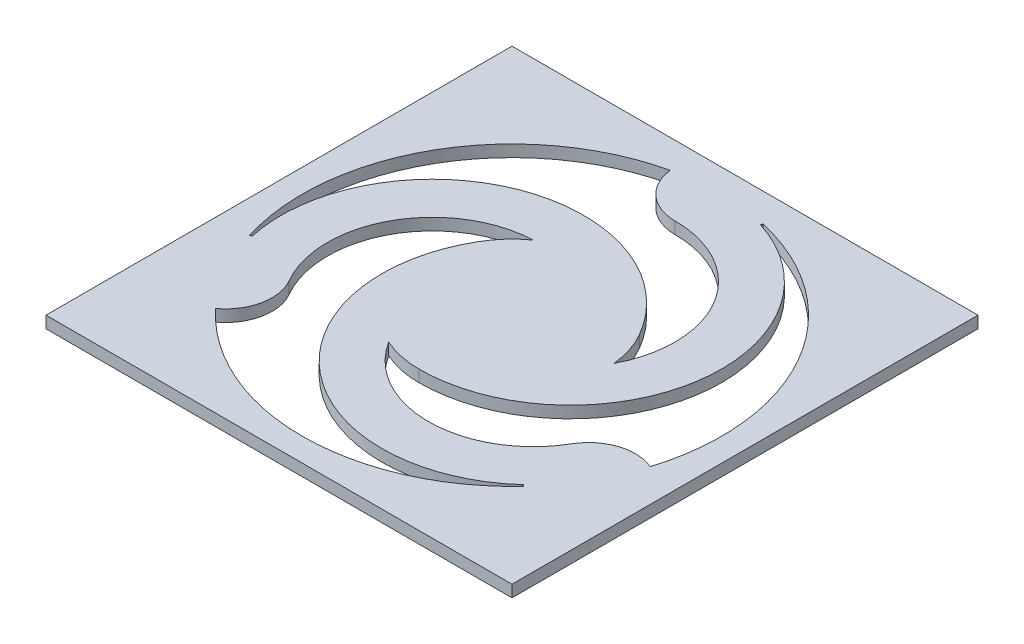
ISO-10303-21;
HEADER;
FILE_DESCRIPTION(('STEP AP214'),'2;1');
FILE_NAME('part.step','',(''),(''),'','','');
FILE_SCHEMA(('AUTOMOTIVE_DESIGN { 1 0 10303 214 1 1 1 1 }'));
ENDSEC;
DATA;
#1=APPLICATION_CONTEXT('core data for automotive mechanical design processes');
#2=APPLICATION_PROTOCOL_DEFINITION('international standard','automotive_design',2000,#1);
#3=PRODUCT_CONTEXT('',#1,'mechanical');
#4=PRODUCT('Part','Part','',(#3));
#5=PRODUCT_RELATED_PRODUCT_CATEGORY('part','',(#4));
#6=PRODUCT_DEFINITION_FORMATION('','',#4);
#7=PRODUCT_DEFINITION_CONTEXT('part definition',#1,'design');
#8=PRODUCT_DEFINITION('design','',#6,#7);
#9=PRODUCT_DEFINITION_SHAPE('','',#8);
#10=(LENGTH_UNIT() NAMED_UNIT(*) SI_UNIT(.MILLI.,.METRE.));
#11=(NAMED_UNIT(*) PLANE_ANGLE_UNIT() SI_UNIT($,.RADIAN.));
#12=(NAMED_UNIT(*) SI_UNIT($,.STERADIAN.) SOLID_ANGLE_UNIT());
#13=UNCERTAINTY_MEASURE_WITH_UNIT(LENGTH_MEASURE(1.E-05),#10,'distance_accuracy_value','');
#14=(GEOMETRIC_REPRESENTATION_CONTEXT(3) GLOBAL_UNCERTAINTY_ASSIGNED_CONTEXT((#13)) GLOBAL_UNIT_ASSIGNED_CONTEXT((#10,
#11,#12)) REPRESENTATION_CONTEXT('',''));
#15=CARTESIAN_POINT('',(0.,0.,0.));
#16=DIRECTION('',(0.,0.,1.));
#17=DIRECTION('',(1.,0.,0.));
#18=AXIS2_PLACEMENT_3D('',#15,#16,#17);
#19=CARTESIAN_POINT('',(0.,0.127,0.));
#20=DIRECTION('',(0.,0.,-1.));
#21=DIRECTION('',(-1.,0.,0.));
#22=AXIS2_PLACEMENT_3D('',#19,#20,#21);
#23=PLANE('',#22);
#24=DIRECTION('',(1.,0.,0.));
#25=VECTOR('',#24,1.);
#26=CARTESIAN_POINT('',(0.,0.,0.));
#27=LINE('',#26,#25);
#28=CARTESIAN_POINT('',(0.,0.,0.));
#29=VERTEX_POINT('',#28);
#30=CARTESIAN_POINT('',(5.,0.,0.));
#31=VERTEX_POINT('',#30);
#32=EDGE_CURVE('E291',#29,#31,#27,.T.);
#33=ORIENTED_EDGE('',*,*,#32,.T.);
#34=DIRECTION('',(0.,-1.,0.));
#35=VECTOR('',#34,1.);
#36=CARTESIAN_POINT('',(5.,0.127,0.));
#37=LINE('',#36,#35);
#38=CARTESIAN_POINT('',(5.,0.127,0.));
#39=VERTEX_POINT('',#38);
#40=EDGE_CURVE('E11',#39,#31,#37,.T.);
#41=ORIENTED_EDGE('',*,*,#40,.F.);
#42=DIRECTION('',(1.,0.,0.));
#43=VECTOR('',#42,1.);
#44=CARTESIAN_POINT('',(0.,0.127,0.));
#45=LINE('',#44,#43);
#46=CARTESIAN_POINT('',(0.,0.127,0.));
#47=VERTEX_POINT('',#46);
#48=EDGE_CURVE('E209',#47,#39,#45,.T.);
#49=ORIENTED_EDGE('',*,*,#48,.F.);
#50=DIRECTION('',(0.,-1.,0.));
#51=VECTOR('',#50,1.);
#52=CARTESIAN_POINT('',(0.,0.127,0.));
#53=LINE('',#52,#51);
#54=EDGE_CURVE('E63',#47,#29,#53,.T.);
#55=ORIENTED_EDGE('',*,*,#54,.T.);
#56=EDGE_LOOP('',(#33,#41,#49,#55));
#57=FACE_BOUND('',#56,.T.);
#58=ADVANCED_FACE('F43',(#57),#23,.F.);
#59=CARTESIAN_POINT('',(5.,0.127,0.));
#60=DIRECTION('',(-1.,0.,0.));
#61=DIRECTION('',(0.,0.,1.));
#62=AXIS2_PLACEMENT_3D('',#59,#60,#61);
#63=PLANE('',#62);
#64=DIRECTION('',(0.,0.,-1.));
#65=VECTOR('',#64,1.);
#66=CARTESIAN_POINT('',(5.,0.,0.));
#67=LINE('',#66,#65);
#68=CARTESIAN_POINT('',(5.,0.,-5.));
#69=VERTEX_POINT('',#68);
#70=EDGE_CURVE('E216',#31,#69,#67,.T.);
#71=ORIENTED_EDGE('',*,*,#70,.T.);
#72=DIRECTION('',(0.,-1.,0.));
#73=VECTOR('',#72,1.);
#74=CARTESIAN_POINT('',(5.,0.127,-5.));
#75=LINE('',#74,#73);
#76=CARTESIAN_POINT('',(5.,0.127,-5.));
#77=VERTEX_POINT('',#76);
#78=EDGE_CURVE('E54',#77,#69,#75,.T.);
#79=ORIENTED_EDGE('',*,*,#78,.F.);
#80=DIRECTION('',(0.,0.,-1.));
#81=VECTOR('',#80,1.);
#82=CARTESIAN_POINT('',(5.,0.127,0.));
#83=LINE('',#82,#81);
#84=EDGE_CURVE('E203',#39,#77,#83,.T.);
#85=ORIENTED_EDGE('',*,*,#84,.F.);
#86=ORIENTED_EDGE('',*,*,#40,.T.);
#87=EDGE_LOOP('',(#71,#79,#85,#86));
#88=FACE_BOUND('',#87,.T.);
#89=ADVANCED_FACE('F215',(#88),#63,.F.);
#90=CARTESIAN_POINT('',(0.,0.127,-5.));
#91=DIRECTION('',(0.,0.,-1.));
#92=DIRECTION('',(-1.,0.,0.));
#93=AXIS2_PLACEMENT_3D('',#90,#91,#92);
#94=PLANE('',#93);
#95=DIRECTION('',(1.,0.,0.));
#96=VECTOR('',#95,1.);
#97=CARTESIAN_POINT('',(0.,0.,-5.));
#98=LINE('',#97,#96);
#99=CARTESIAN_POINT('',(0.,0.,-5.));
#100=VERTEX_POINT('',#99);
#101=EDGE_CURVE('E296',#100,#69,#98,.T.);
#102=ORIENTED_EDGE('',*,*,#101,.F.);
#103=DIRECTION('',(0.,-1.,0.));
#104=VECTOR('',#103,1.);
#105=CARTESIAN_POINT('',(0.,0.127,-5.));
#106=LINE('',#105,#104);
#107=CARTESIAN_POINT('',(0.,0.127,-5.));
#108=VERTEX_POINT('',#107);
#109=EDGE_CURVE('E131',#108,#100,#106,.T.);
#110=ORIENTED_EDGE('',*,*,#109,.F.);
#111=DIRECTION('',(1.,0.,0.));
#112=VECTOR('',#111,1.);
#113=CARTESIAN_POINT('',(0.,0.127,-5.));
#114=LINE('',#113,#112);
#115=EDGE_CURVE('E208',#108,#77,#114,.T.);
#116=ORIENTED_EDGE('',*,*,#115,.T.);
#117=ORIENTED_EDGE('',*,*,#78,.T.);
#118=EDGE_LOOP('',(#102,#110,#116,#117));
#119=FACE_BOUND('',#118,.T.);
#120=ADVANCED_FACE('F221',(#119),#94,.T.);
#121=CARTESIAN_POINT('',(3.0412658773653,0.127,-2.18750000000001));
#122=DIRECTION('',(0.,-1.,0.));
#123=DIRECTION('',(0.,0.,-1.));
#124=AXIS2_PLACEMENT_3D('',#121,#122,#123);
#125=CYLINDRICAL_SURFACE('',#124,1.125);
#126=CARTESIAN_POINT('',(3.0412658773653,0.,-2.18750000000001));
#127=DIRECTION('',(0.,1.,0.));
#128=DIRECTION('',(0.,0.,1.));
#129=AXIS2_PLACEMENT_3D('',#126,#127,#128);
#130=CIRCLE('',#129,1.125);
#131=CARTESIAN_POINT('',(2.08910882182518,0.,-1.58831560301927));
#132=VERTEX_POINT('',#131);
#133=CARTESIAN_POINT('',(4.01554445662279,0.,-1.62500000000001));
#134=VERTEX_POINT('',#133);
#135=EDGE_CURVE('E275',#132,#134,#130,.T.);
#136=ORIENTED_EDGE('',*,*,#135,.F.);
#137=DIRECTION('',(0.,-1.,0.));
#138=VECTOR('',#137,1.);
#139=CARTESIAN_POINT('',(2.08910882182518,0.127,-1.58831560301927));
#140=LINE('',#139,#138);
#141=CARTESIAN_POINT('',(2.08910882182518,0.127,-1.58831560301927));
#142=VERTEX_POINT('',#141);
#143=EDGE_CURVE('E305',#142,#132,#140,.T.);
#144=ORIENTED_EDGE('',*,*,#143,.F.);
#145=CARTESIAN_POINT('',(3.0412658773653,0.127,-2.18750000000001));
#146=DIRECTION('',(0.,1.,0.));
#147=DIRECTION('',(0.,0.,1.));
#148=AXIS2_PLACEMENT_3D('',#145,#146,#147);
#149=CIRCLE('',#148,1.125);
#150=CARTESIAN_POINT('',(4.01554445662279,0.127,-1.62500000000001));
#151=VERTEX_POINT('',#150);
#152=EDGE_CURVE('E421',#142,#151,#149,.T.);
#153=ORIENTED_EDGE('',*,*,#152,.T.);
#154=DIRECTION('',(0.,-1.,0.));
#155=VECTOR('',#154,1.);
#156=CARTESIAN_POINT('',(4.01554445662279,0.127,-1.62500000000001));
#157=LINE('',#156,#155);
#158=EDGE_CURVE('E308',#151,#134,#157,.T.);
#159=ORIENTED_EDGE('',*,*,#158,.T.);
#160=EDGE_LOOP('',(#136,#144,#153,#159));
#161=FACE_BOUND('',#160,.T.);
#162=ADVANCED_FACE('F480',(#161),#125,.F.);
#163=CARTESIAN_POINT('',(2.5,0.127,-2.5));
#164=DIRECTION('',(0.,-1.,0.));
#165=DIRECTION('',(0.,0.,-1.));
#166=AXIS2_PLACEMENT_3D('',#163,#164,#165);
#167=CYLINDRICAL_SURFACE('',#166,1.);
#168=CARTESIAN_POINT('',(2.5,0.,-2.5));
#169=DIRECTION('',(0.,1.,0.));
#170=DIRECTION('',(0.,0.,1.));
#171=AXIS2_PLACEMENT_3D('',#168,#169,#170);
#172=CIRCLE('',#171,1.);
#173=CARTESIAN_POINT('',(2.5,0.,-1.5));
#174=VERTEX_POINT('',#173);
#175=EDGE_CURVE('E263',#132,#174,#172,.T.);
#176=ORIENTED_EDGE('',*,*,#175,.T.);
#177=DIRECTION('',(0.,-1.,0.));
#178=VECTOR('',#177,1.);
#179=CARTESIAN_POINT('',(2.5,0.127,-1.5));
#180=LINE('',#179,#178);
#181=CARTESIAN_POINT('',(2.5,0.127,-1.5));
#182=VERTEX_POINT('',#181);
#183=EDGE_CURVE('E322',#182,#174,#180,.T.);
#184=ORIENTED_EDGE('',*,*,#183,.F.);
#185=CARTESIAN_POINT('',(2.5,0.127,-2.5));
#186=DIRECTION('',(0.,1.,0.));
#187=DIRECTION('',(0.,0.,1.));
#188=AXIS2_PLACEMENT_3D('',#185,#186,#187);
#189=CIRCLE('',#188,1.);
#190=EDGE_CURVE('E411',#142,#182,#189,.T.);
#191=ORIENTED_EDGE('',*,*,#190,.F.);
#192=ORIENTED_EDGE('',*,*,#143,.T.);
#193=EDGE_LOOP('',(#176,#184,#191,#192));
#194=FACE_BOUND('',#193,.T.);
#195=ADVANCED_FACE('F486',(#194),#167,.T.);
#196=CARTESIAN_POINT('',(2.5,0.127,-3.125));
#197=DIRECTION('',(0.,-1.,0.));
#198=DIRECTION('',(0.,0.,-1.));
#199=AXIS2_PLACEMENT_3D('',#196,#197,#198);
#200=CYLINDRICAL_SURFACE('',#199,1.625);
#201=CARTESIAN_POINT('',(2.5,0.,-3.125));
#202=DIRECTION('',(0.,1.,0.));
#203=DIRECTION('',(0.,0.,1.));
#204=AXIS2_PLACEMENT_3D('',#201,#202,#203);
#205=CIRCLE('',#204,1.625);
#206=CARTESIAN_POINT('',(2.99404740687174,0.,-4.67307692307692));
#207=VERTEX_POINT('',#206);
#208=EDGE_CURVE('E279',#174,#207,#205,.T.);
#209=ORIENTED_EDGE('',*,*,#208,.T.);
#210=DIRECTION('',(0.,-1.,0.));
#211=VECTOR('',#210,1.);
#212=CARTESIAN_POINT('',(2.99404740687174,0.127,-4.67307692307692));
#213=LINE('',#212,#211);
#214=CARTESIAN_POINT('',(2.99404740687174,0.127,-4.67307692307692));
#215=VERTEX_POINT('',#214);
#216=EDGE_CURVE('E318',#215,#207,#213,.T.);
#217=ORIENTED_EDGE('',*,*,#216,.F.);
#218=CARTESIAN_POINT('',(2.5,0.127,-3.125));
#219=DIRECTION('',(0.,1.,0.));
#220=DIRECTION('',(0.,0.,1.));
#221=AXIS2_PLACEMENT_3D('',#218,#219,#220);
#222=CIRCLE('',#221,1.625);
#223=EDGE_CURVE('E425',#182,#215,#222,.T.);
#224=ORIENTED_EDGE('',*,*,#223,.F.);
#225=ORIENTED_EDGE('',*,*,#183,.T.);
#226=EDGE_LOOP('',(#209,#217,#224,#225));
#227=FACE_BOUND('',#226,.T.);
#228=ADVANCED_FACE('F472',(#227),#200,.T.);
#229=CARTESIAN_POINT('',(2.5,0.127,-4.75));
#230=DIRECTION('',(0.,-1.,0.));
#231=DIRECTION('',(0.,0.,-1.));
#232=AXIS2_PLACEMENT_3D('',#229,#230,#231);
#233=CYLINDRICAL_SURFACE('',#232,0.5);
#234=CARTESIAN_POINT('',(2.5,0.,-4.75));
#235=DIRECTION('',(0.,1.,0.));
#236=DIRECTION('',(0.,0.,1.));
#237=AXIS2_PLACEMENT_3D('',#234,#235,#236);
#238=CIRCLE('',#237,0.5);
#239=CARTESIAN_POINT('',(2.99690399499995,0.,-4.69444444444444));
#240=VERTEX_POINT('',#239);
#241=EDGE_CURVE('E283',#207,#240,#238,.T.);
#242=ORIENTED_EDGE('',*,*,#241,.T.);
#243=DIRECTION('',(0.,-1.,0.));
#244=VECTOR('',#243,1.);
#245=CARTESIAN_POINT('',(2.99690399499995,0.127,-4.69444444444444));
#246=LINE('',#245,#244);
#247=CARTESIAN_POINT('',(2.99690399499995,0.127,-4.69444444444444));
#248=VERTEX_POINT('',#247);
#249=EDGE_CURVE('E315',#248,#240,#246,.T.);
#250=ORIENTED_EDGE('',*,*,#249,.F.);
#251=CARTESIAN_POINT('',(2.5,0.127,-4.75));
#252=DIRECTION('',(0.,1.,0.));
#253=DIRECTION('',(0.,0.,1.));
#254=AXIS2_PLACEMENT_3D('',#251,#252,#253);
#255=CIRCLE('',#254,0.5);
#256=EDGE_CURVE('E429',#215,#248,#255,.T.);
#257=ORIENTED_EDGE('',*,*,#256,.F.);
#258=ORIENTED_EDGE('',*,*,#216,.T.);
#259=EDGE_LOOP('',(#242,#250,#257,#258));
#260=FACE_BOUND('',#259,.T.);
#261=ADVANCED_FACE('F469',(#260),#233,.T.);
#262=CARTESIAN_POINT('',(2.5,0.127,-2.5));
#263=DIRECTION('',(0.,-1.,0.));
#264=DIRECTION('',(0.,0.,-1.));
#265=AXIS2_PLACEMENT_3D('',#262,#263,#264);
#266=CYLINDRICAL_SURFACE('',#265,2.25);
#267=CARTESIAN_POINT('',(2.5,0.,-2.5));
#268=DIRECTION('',(0.,1.,0.));
#269=DIRECTION('',(0.,0.,1.));
#270=AXIS2_PLACEMENT_3D('',#267,#268,#269);
#271=CIRCLE('',#270,2.25);
#272=CARTESIAN_POINT('',(4.6488966335825,0.,-1.83310926068973));
#273=VERTEX_POINT('',#272);
#274=EDGE_CURVE('E253',#273,#240,#271,.T.);
#275=ORIENTED_EDGE('',*,*,#274,.F.);
#276=DIRECTION('',(0.,-1.,0.));
#277=VECTOR('',#276,1.);
#278=CARTESIAN_POINT('',(4.6488966335825,0.127,-1.83310926068973));
#279=LINE('',#278,#277);
#280=CARTESIAN_POINT('',(4.6488966335825,0.127,-1.83310926068973));
#281=VERTEX_POINT('',#280);
#282=EDGE_CURVE('E311',#281,#273,#279,.T.);
#283=ORIENTED_EDGE('',*,*,#282,.F.);
#284=CARTESIAN_POINT('',(2.5,0.127,-2.5));
#285=DIRECTION('',(0.,1.,0.));
#286=DIRECTION('',(0.,0.,1.));
#287=AXIS2_PLACEMENT_3D('',#284,#285,#286);
#288=CIRCLE('',#287,2.25);
#289=EDGE_CURVE('E401',#281,#248,#288,.T.);
#290=ORIENTED_EDGE('',*,*,#289,.T.);
#291=ORIENTED_EDGE('',*,*,#249,.T.);
#292=EDGE_LOOP('',(#275,#283,#290,#291));
#293=FACE_BOUND('',#292,.T.);
#294=ADVANCED_FACE('F464',(#293),#266,.F.);
#295=CARTESIAN_POINT('',(1.95873412263475,0.127,-2.18749999999999));
#296=DIRECTION('',(0.,-1.,0.));
#297=DIRECTION('',(0.,0.,-1.));
#298=AXIS2_PLACEMENT_3D('',#295,#296,#297);
#299=CYLINDRICAL_SURFACE('',#298,1.125);
#300=CARTESIAN_POINT('',(1.95873412263475,0.,-2.18749999999999));
#301=DIRECTION('',(0.,1.,0.));
#302=DIRECTION('',(0.,0.,1.));
#303=AXIS2_PLACEMENT_3D('',#300,#301,#302);
#304=CIRCLE('',#303,1.125);
#305=CARTESIAN_POINT('',(1.91590374106823,0.,-3.31168439698069));
#306=VERTEX_POINT('',#305);
#307=CARTESIAN_POINT('',(0.98445554337725,0.,-1.625));
#308=VERTEX_POINT('',#307);
#309=EDGE_CURVE('E252',#306,#308,#304,.T.);
#310=ORIENTED_EDGE('',*,*,#309,.F.);
#311=DIRECTION('',(0.,-1.,0.));
#312=VECTOR('',#311,1.);
#313=CARTESIAN_POINT('',(1.91590374106823,0.127,-3.31168439698069));
#314=LINE('',#313,#312);
#315=CARTESIAN_POINT('',(1.91590374106823,0.127,-3.31168439698069));
#316=VERTEX_POINT('',#315);
#317=EDGE_CURVE('E312',#316,#306,#314,.T.);
#318=ORIENTED_EDGE('',*,*,#317,.F.);
#319=CARTESIAN_POINT('',(1.95873412263475,0.127,-2.18749999999999));
#320=DIRECTION('',(0.,1.,0.));
#321=DIRECTION('',(0.,0.,1.));
#322=AXIS2_PLACEMENT_3D('',#319,#320,#321);
#323=CIRCLE('',#322,1.125);
#324=CARTESIAN_POINT('',(0.98445554337725,0.127,-1.625));
#325=VERTEX_POINT('',#324);
#326=EDGE_CURVE('E400',#316,#325,#323,.T.);
#327=ORIENTED_EDGE('',*,*,#326,.T.);
#328=DIRECTION('',(0.,-1.,0.));
#329=VECTOR('',#328,1.);
#330=CARTESIAN_POINT('',(0.98445554337725,0.127,-1.625));
#331=LINE('',#330,#329);
#332=EDGE_CURVE('E328',#325,#308,#331,.T.);
#333=ORIENTED_EDGE('',*,*,#332,.T.);
#334=EDGE_LOOP('',(#310,#318,#327,#333));
#335=FACE_BOUND('',#334,.T.);
#336=ADVANCED_FACE('F498',(#335),#299,.F.);
#337=CARTESIAN_POINT('',(1.63397459621554,0.,-2.99999999999997));
#338=VERTEX_POINT('',#337);
#339=EDGE_CURVE('E258',#306,#338,#172,.T.);
#340=ORIENTED_EDGE('',*,*,#339,.T.);
#341=DIRECTION('',(0.,-1.,0.));
#342=VECTOR('',#341,1.);
#343=CARTESIAN_POINT('',(1.63397459621554,0.127,-2.99999999999997));
#344=LINE('',#343,#342);
#345=CARTESIAN_POINT('',(1.63397459621554,0.127,-2.99999999999997));
#346=VERTEX_POINT('',#345);
#347=EDGE_CURVE('E341',#346,#338,#344,.T.);
#348=ORIENTED_EDGE('',*,*,#347,.F.);
#349=EDGE_CURVE('E406',#316,#346,#189,.T.);
#350=ORIENTED_EDGE('',*,*,#349,.F.);
#351=ORIENTED_EDGE('',*,*,#317,.T.);
#352=EDGE_LOOP('',(#340,#348,#350,#351));
#353=FACE_BOUND('',#352,.T.);
#354=ADVANCED_FACE('F489',(#353),#167,.T.);
#355=CARTESIAN_POINT('',(3.0412658773653,0.127,-2.18750000000001));
#356=DIRECTION('',(0.,-1.,0.));
#357=DIRECTION('',(0.,0.,-1.));
#358=AXIS2_PLACEMENT_3D('',#355,#356,#357);
#359=CYLINDRICAL_SURFACE('',#358,1.625);
#360=CARTESIAN_POINT('',(3.0412658773653,0.,-2.18750000000001));
#361=DIRECTION('',(0.,1.,0.));
#362=DIRECTION('',(0.,0.,1.));
#363=AXIS2_PLACEMENT_3D('',#360,#361,#362);
#364=CIRCLE('',#363,1.625);
#365=CARTESIAN_POINT('',(4.13491611632649,0.,-0.985603933436795));
#366=VERTEX_POINT('',#365);
#367=EDGE_CURVE('E262',#338,#366,#364,.T.);
#368=ORIENTED_EDGE('',*,*,#367,.T.);
#369=DIRECTION('',(0.,-1.,0.));
#370=VECTOR('',#369,1.);
#371=CARTESIAN_POINT('',(4.13491611632649,0.127,-0.985603933436795));
#372=LINE('',#371,#370);
#373=CARTESIAN_POINT('',(4.13491611632649,0.127,-0.985603933436795));
#374=VERTEX_POINT('',#373);
#375=EDGE_CURVE('E337',#374,#366,#372,.T.);
#376=ORIENTED_EDGE('',*,*,#375,.F.);
#377=CARTESIAN_POINT('',(3.0412658773653,0.127,-2.18750000000001));
#378=DIRECTION('',(0.,1.,0.));
#379=DIRECTION('',(0.,0.,1.));
#380=AXIS2_PLACEMENT_3D('',#377,#378,#379);
#381=CIRCLE('',#380,1.625);
#382=EDGE_CURVE('E410',#346,#374,#381,.T.);
#383=ORIENTED_EDGE('',*,*,#382,.F.);
#384=ORIENTED_EDGE('',*,*,#347,.T.);
#385=EDGE_LOOP('',(#368,#376,#383,#384));
#386=FACE_BOUND('',#385,.T.);
#387=ADVANCED_FACE('F497',(#386),#359,.T.);
#388=CARTESIAN_POINT('',(4.44855715851501,0.127,-1.375));
#389=DIRECTION('',(0.,-1.,0.));
#390=DIRECTION('',(0.,0.,-1.));
#391=AXIS2_PLACEMENT_3D('',#388,#389,#390);
#392=CYLINDRICAL_SURFACE('',#391,0.5);
#393=CARTESIAN_POINT('',(4.44855715851501,0.,-1.375));
#394=DIRECTION('',(0.,1.,0.));
#395=DIRECTION('',(0.,0.,1.));
#396=AXIS2_PLACEMENT_3D('',#393,#394,#395);
#397=CIRCLE('',#396,0.5);
#398=CARTESIAN_POINT('',(4.15199263858255,0.,-0.972446294865855));
#399=VERTEX_POINT('',#398);
#400=EDGE_CURVE('E267',#366,#399,#397,.T.);
#401=ORIENTED_EDGE('',*,*,#400,.T.);
#402=DIRECTION('',(0.,-1.,0.));
#403=VECTOR('',#402,1.);
#404=CARTESIAN_POINT('',(4.15199263858255,0.127,-0.972446294865855));
#405=LINE('',#404,#403);
#406=CARTESIAN_POINT('',(4.15199263858255,0.127,-0.972446294865855));
#407=VERTEX_POINT('',#406);
#408=EDGE_CURVE('E334',#407,#399,#405,.T.);
#409=ORIENTED_EDGE('',*,*,#408,.F.);
#410=CARTESIAN_POINT('',(4.44855715851501,0.127,-1.375));
#411=DIRECTION('',(0.,1.,0.));
#412=DIRECTION('',(0.,0.,1.));
#413=AXIS2_PLACEMENT_3D('',#410,#411,#412);
#414=CIRCLE('',#413,0.5);
#415=EDGE_CURVE('E415',#374,#407,#414,.T.);
#416=ORIENTED_EDGE('',*,*,#415,.F.);
#417=ORIENTED_EDGE('',*,*,#375,.T.);
#418=EDGE_LOOP('',(#401,#409,#416,#417));
#419=FACE_BOUND('',#418,.T.);
#420=ADVANCED_FACE('F453',(#419),#392,.T.);
#421=CARTESIAN_POINT('',(0.848007361417463,0.,-0.972446294865837));
#422=VERTEX_POINT('',#421);
#423=EDGE_CURVE('E254',#422,#399,#271,.T.);
#424=ORIENTED_EDGE('',*,*,#423,.F.);
#425=DIRECTION('',(0.,-1.,0.));
#426=VECTOR('',#425,1.);
#427=CARTESIAN_POINT('',(0.848007361417463,0.127,-0.972446294865837));
#428=LINE('',#427,#426);
#429=CARTESIAN_POINT('',(0.848007361417463,0.127,-0.972446294865837));
#430=VERTEX_POINT('',#429);
#431=EDGE_CURVE('E331',#430,#422,#428,.T.);
#432=ORIENTED_EDGE('',*,*,#431,.F.);
#433=EDGE_CURVE('E402',#430,#407,#288,.T.);
#434=ORIENTED_EDGE('',*,*,#433,.T.);
#435=ORIENTED_EDGE('',*,*,#408,.T.);
#436=EDGE_LOOP('',(#424,#432,#434,#435));
#437=FACE_BOUND('',#436,.T.);
#438=ADVANCED_FACE('F444',(#437),#266,.F.);
#439=CARTESIAN_POINT('',(2.5,0.127,-4.75));
#440=DIRECTION('',(0.,-1.,0.));
#441=DIRECTION('',(0.,0.,-1.));
#442=AXIS2_PLACEMENT_3D('',#439,#440,#441);
#443=CYLINDRICAL_SURFACE('',#442,0.500000000000001);
#444=CARTESIAN_POINT('',(2.5,0.,-4.75));
#445=DIRECTION('',(0.,1.,0.));
#446=DIRECTION('',(0.,0.,1.));
#447=AXIS2_PLACEMENT_3D('',#444,#445,#446);
#448=CIRCLE('',#447,0.500000000000001);
#449=CARTESIAN_POINT('',(2.00309600500005,0.,-4.69444444444444));
#450=VERTEX_POINT('',#449);
#451=CARTESIAN_POINT('',(2.5,0.,-4.25));
#452=VERTEX_POINT('',#451);
#453=EDGE_CURVE('E230',#450,#452,#448,.T.);
#454=ORIENTED_EDGE('',*,*,#453,.T.);
#455=DIRECTION('',(0.,-1.,0.));
#456=VECTOR('',#455,1.);
#457=CARTESIAN_POINT('',(2.5,0.127,-4.25));
#458=LINE('',#457,#456);
#459=CARTESIAN_POINT('',(2.5,0.127,-4.25));
#460=VERTEX_POINT('',#459);
#461=EDGE_CURVE('E47',#460,#452,#458,.T.);
#462=ORIENTED_EDGE('',*,*,#461,.F.);
#463=CARTESIAN_POINT('',(2.5,0.127,-4.75));
#464=DIRECTION('',(0.,1.,0.));
#465=DIRECTION('',(0.,0.,1.));
#466=AXIS2_PLACEMENT_3D('',#463,#464,#465);
#467=CIRCLE('',#466,0.500000000000001);
#468=CARTESIAN_POINT('',(2.00309600500005,0.127,-4.69444444444444));
#469=VERTEX_POINT('',#468);
#470=EDGE_CURVE('E144',#469,#460,#467,.T.);
#471=ORIENTED_EDGE('',*,*,#470,.F.);
#472=DIRECTION('',(0.,-1.,0.));
#473=VECTOR('',#472,1.);
#474=CARTESIAN_POINT('',(2.00309600500005,0.127,-4.69444444444444));
#475=LINE('',#474,#473);
#476=EDGE_CURVE('E226',#469,#450,#475,.T.);
#477=ORIENTED_EDGE('',*,*,#476,.T.);
#478=EDGE_LOOP('',(#454,#462,#471,#477));
#479=FACE_BOUND('',#478,.T.);
#480=ADVANCED_FACE('F45',(#479),#443,.T.);
#481=CARTESIAN_POINT('',(2.5,0.127,-3.125));
#482=DIRECTION('',(0.,-1.,0.));
#483=DIRECTION('',(0.,0.,-1.));
#484=AXIS2_PLACEMENT_3D('',#481,#482,#483);
#485=CYLINDRICAL_SURFACE('',#484,1.125);
#486=CARTESIAN_POINT('',(2.5,0.,-3.125));
#487=DIRECTION('',(0.,1.,0.));
#488=DIRECTION('',(0.,0.,1.));
#489=AXIS2_PLACEMENT_3D('',#486,#487,#488);
#490=CIRCLE('',#489,1.125);
#491=CARTESIAN_POINT('',(3.49498743710662,0.,-2.6));
#492=VERTEX_POINT('',#491);
#493=EDGE_CURVE('E234',#492,#452,#490,.T.);
#494=ORIENTED_EDGE('',*,*,#493,.F.);
#495=DIRECTION('',(0.,-1.,0.));
#496=VECTOR('',#495,1.);
#497=CARTESIAN_POINT('',(3.49498743710662,0.127,-2.6));
#498=LINE('',#497,#496);
#499=CARTESIAN_POINT('',(3.49498743710662,0.127,-2.6));
#500=VERTEX_POINT('',#499);
#501=EDGE_CURVE('E359',#500,#492,#498,.T.);
#502=ORIENTED_EDGE('',*,*,#501,.F.);
#503=CARTESIAN_POINT('',(2.5,0.127,-3.125));
#504=DIRECTION('',(0.,1.,0.));
#505=DIRECTION('',(0.,0.,1.));
#506=AXIS2_PLACEMENT_3D('',#503,#504,#505);
#507=CIRCLE('',#506,1.125);
#508=EDGE_CURVE('E369',#500,#460,#507,.T.);
#509=ORIENTED_EDGE('',*,*,#508,.T.);
#510=ORIENTED_EDGE('',*,*,#461,.T.);
#511=EDGE_LOOP('',(#494,#502,#509,#510));
#512=FACE_BOUND('',#511,.T.);
#513=ADVANCED_FACE('F368',(#512),#485,.F.);
#514=CARTESIAN_POINT('',(2.5,0.127,-2.5));
#515=DIRECTION('',(0.,-1.,0.));
#516=DIRECTION('',(0.,0.,-1.));
#517=AXIS2_PLACEMENT_3D('',#514,#515,#516);
#518=CYLINDRICAL_SURFACE('',#517,1.);
#519=CARTESIAN_POINT('',(2.5,0.,-2.5));
#520=DIRECTION('',(0.,1.,0.));
#521=DIRECTION('',(0.,0.,1.));
#522=AXIS2_PLACEMENT_3D('',#519,#520,#521);
#523=CIRCLE('',#522,1.);
#524=CARTESIAN_POINT('',(3.36602540378442,0.,-3.00000000000003));
#525=VERTEX_POINT('',#524);
#526=EDGE_CURVE('E238',#492,#525,#523,.T.);
#527=ORIENTED_EDGE('',*,*,#526,.T.);
#528=DIRECTION('',(0.,-1.,0.));
#529=VECTOR('',#528,1.);
#530=CARTESIAN_POINT('',(3.36602540378442,0.127,-3.00000000000003));
#531=LINE('',#530,#529);
#532=CARTESIAN_POINT('',(3.36602540378442,0.127,-3.00000000000003));
#533=VERTEX_POINT('',#532);
#534=EDGE_CURVE('E356',#533,#525,#531,.T.);
#535=ORIENTED_EDGE('',*,*,#534,.F.);
#536=CARTESIAN_POINT('',(2.5,0.127,-2.5));
#537=DIRECTION('',(0.,1.,0.));
#538=DIRECTION('',(0.,0.,1.));
#539=AXIS2_PLACEMENT_3D('',#536,#537,#538);
#540=CIRCLE('',#539,1.);
#541=EDGE_CURVE('E388',#500,#533,#540,.T.);
#542=ORIENTED_EDGE('',*,*,#541,.F.);
#543=ORIENTED_EDGE('',*,*,#501,.T.);
#544=EDGE_LOOP('',(#527,#535,#542,#543));
#545=FACE_BOUND('',#544,.T.);
#546=ADVANCED_FACE('F379',(#545),#518,.T.);
#547=CARTESIAN_POINT('',(1.95873412263475,0.127,-2.18749999999999));
#548=DIRECTION('',(0.,-1.,0.));
#549=DIRECTION('',(0.,0.,-1.));
#550=AXIS2_PLACEMENT_3D('',#547,#548,#549);
#551=CYLINDRICAL_SURFACE('',#550,1.625);
#552=CARTESIAN_POINT('',(1.95873412263475,0.,-2.18749999999999));
#553=DIRECTION('',(0.,1.,0.));
#554=DIRECTION('',(0.,0.,1.));
#555=AXIS2_PLACEMENT_3D('',#552,#553,#554);
#556=CIRCLE('',#555,1.625);
#557=CARTESIAN_POINT('',(0.371036476801813,0.,-1.84131914348629));
#558=VERTEX_POINT('',#557);
#559=EDGE_CURVE('E241',#525,#558,#556,.T.);
#560=ORIENTED_EDGE('',*,*,#559,.T.);
#561=DIRECTION('',(0.,-1.,0.));
#562=VECTOR('',#561,1.);
#563=CARTESIAN_POINT('',(0.371036476801813,0.127,-1.84131914348629));
#564=LINE('',#563,#562);
#565=CARTESIAN_POINT('',(0.371036476801813,0.127,-1.84131914348629));
#566=VERTEX_POINT('',#565);
#567=EDGE_CURVE('E352',#566,#558,#564,.T.);
#568=ORIENTED_EDGE('',*,*,#567,.F.);
#569=CARTESIAN_POINT('',(1.95873412263475,0.127,-2.18749999999999));
#570=DIRECTION('',(0.,1.,0.));
#571=DIRECTION('',(0.,0.,1.));
#572=AXIS2_PLACEMENT_3D('',#569,#570,#571);
#573=CIRCLE('',#572,1.625);
#574=EDGE_CURVE('E384',#533,#566,#573,.T.);
#575=ORIENTED_EDGE('',*,*,#574,.F.);
#576=ORIENTED_EDGE('',*,*,#534,.T.);
#577=EDGE_LOOP('',(#560,#568,#575,#576));
#578=FACE_BOUND('',#577,.T.);
#579=ADVANCED_FACE('F382',(#578),#551,.T.);
#580=CARTESIAN_POINT('',(0.551442841485028,0.127,-1.375));
#581=DIRECTION('',(0.,-1.,0.));
#582=DIRECTION('',(0.,0.,-1.));
#583=AXIS2_PLACEMENT_3D('',#580,#581,#582);
#584=CYLINDRICAL_SURFACE('',#583,0.500000000000001);
#585=CARTESIAN_POINT('',(0.551442841485028,0.,-1.375));
#586=DIRECTION('',(0.,1.,0.));
#587=DIRECTION('',(0.,0.,1.));
#588=AXIS2_PLACEMENT_3D('',#585,#586,#587);
#589=CIRCLE('',#588,0.500000000000001);
#590=CARTESIAN_POINT('',(0.351103366417505,0.,-1.83310926068971));
#591=VERTEX_POINT('',#590);
#592=EDGE_CURVE('E244',#558,#591,#589,.T.);
#593=ORIENTED_EDGE('',*,*,#592,.T.);
#594=DIRECTION('',(0.,-1.,0.));
#595=VECTOR('',#594,1.);
#596=CARTESIAN_POINT('',(0.351103366417505,0.127,-1.83310926068971));
#597=LINE('',#596,#595);
#598=CARTESIAN_POINT('',(0.351103366417505,0.127,-1.83310926068971));
#599=VERTEX_POINT('',#598);
#600=EDGE_CURVE('E349',#599,#591,#597,.T.);
#601=ORIENTED_EDGE('',*,*,#600,.F.);
#602=CARTESIAN_POINT('',(0.551442841485028,0.127,-1.375));
#603=DIRECTION('',(0.,1.,0.));
#604=DIRECTION('',(0.,0.,1.));
#605=AXIS2_PLACEMENT_3D('',#602,#603,#604);
#606=CIRCLE('',#605,0.500000000000001);
#607=EDGE_CURVE('E387',#566,#599,#606,.T.);
#608=ORIENTED_EDGE('',*,*,#607,.F.);
#609=ORIENTED_EDGE('',*,*,#567,.T.);
#610=EDGE_LOOP('',(#593,#601,#608,#609));
#611=FACE_BOUND('',#610,.T.);
#612=ADVANCED_FACE('F511',(#611),#584,.T.);
#613=CARTESIAN_POINT('',(4.44855715851501,0.127,-1.375));
#614=DIRECTION('',(0.,-1.,0.));
#615=DIRECTION('',(0.,0.,-1.));
#616=AXIS2_PLACEMENT_3D('',#613,#614,#615);
#617=CYLINDRICAL_SURFACE('',#616,0.500000000000001);
#618=CARTESIAN_POINT('',(4.44855715851501,0.,-1.375));
#619=DIRECTION('',(0.,1.,0.));
#620=DIRECTION('',(0.,0.,1.));
#621=AXIS2_PLACEMENT_3D('',#618,#619,#620);
#622=CIRCLE('',#621,0.500000000000001);
#623=EDGE_CURVE('E287',#273,#134,#622,.T.);
#624=ORIENTED_EDGE('',*,*,#623,.T.);
#625=ORIENTED_EDGE('',*,*,#158,.F.);
#626=CARTESIAN_POINT('',(4.44855715851501,0.127,-1.375));
#627=DIRECTION('',(0.,1.,0.));
#628=DIRECTION('',(0.,0.,1.));
#629=AXIS2_PLACEMENT_3D('',#626,#627,#628);
#630=CIRCLE('',#629,0.500000000000001);
#631=EDGE_CURVE('E432',#281,#151,#630,.T.);
#632=ORIENTED_EDGE('',*,*,#631,.F.);
#633=ORIENTED_EDGE('',*,*,#282,.T.);
#634=EDGE_LOOP('',(#624,#625,#632,#633));
#635=FACE_BOUND('',#634,.T.);
#636=ADVANCED_FACE('F485',(#635),#617,.T.);
#637=CARTESIAN_POINT('',(0.551442841485028,0.127,-1.375));
#638=DIRECTION('',(0.,-1.,0.));
#639=DIRECTION('',(0.,0.,-1.));
#640=AXIS2_PLACEMENT_3D('',#637,#638,#639);
#641=CYLINDRICAL_SURFACE('',#640,0.5);
#642=CARTESIAN_POINT('',(0.551442841485028,0.,-1.375));
#643=DIRECTION('',(0.,1.,0.));
#644=DIRECTION('',(0.,0.,1.));
#645=AXIS2_PLACEMENT_3D('',#642,#643,#644);
#646=CIRCLE('',#645,0.5);
#647=EDGE_CURVE('E271',#422,#308,#646,.T.);
#648=ORIENTED_EDGE('',*,*,#647,.T.);
#649=ORIENTED_EDGE('',*,*,#332,.F.);
#650=CARTESIAN_POINT('',(0.551442841485028,0.127,-1.375));
#651=DIRECTION('',(0.,1.,0.));
#652=DIRECTION('',(0.,0.,1.));
#653=AXIS2_PLACEMENT_3D('',#650,#651,#652);
#654=CIRCLE('',#653,0.5);
#655=EDGE_CURVE('E418',#430,#325,#654,.T.);
#656=ORIENTED_EDGE('',*,*,#655,.F.);
#657=ORIENTED_EDGE('',*,*,#431,.T.);
#658=EDGE_LOOP('',(#648,#649,#656,#657));
#659=FACE_BOUND('',#658,.T.);
#660=ADVANCED_FACE('F510',(#659),#641,.T.);
#661=EDGE_CURVE('E248',#450,#591,#271,.T.);
#662=ORIENTED_EDGE('',*,*,#661,.F.);
#663=ORIENTED_EDGE('',*,*,#476,.F.);
#664=EDGE_CURVE('E392',#469,#599,#288,.T.);
#665=ORIENTED_EDGE('',*,*,#664,.T.);
#666=ORIENTED_EDGE('',*,*,#600,.T.);
#667=EDGE_LOOP('',(#662,#663,#665,#666));
#668=FACE_BOUND('',#667,.T.);
#669=ADVANCED_FACE('F514',(#668),#266,.F.);
#670=CARTESIAN_POINT('',(0.,0.127,0.));
#671=DIRECTION('',(-1.,0.,0.));
#672=DIRECTION('',(0.,0.,1.));
#673=AXIS2_PLACEMENT_3D('',#670,#671,#672);
#674=PLANE('',#673);
#675=DIRECTION('',(0.,0.,-1.));
#676=VECTOR('',#675,1.);
#677=CARTESIAN_POINT('',(0.,0.,0.));
#678=LINE('',#677,#676);
#679=EDGE_CURVE('E299',#29,#100,#678,.T.);
#680=ORIENTED_EDGE('',*,*,#679,.F.);
#681=ORIENTED_EDGE('',*,*,#54,.F.);
#682=DIRECTION('',(0.,0.,-1.));
#683=VECTOR('',#682,1.);
#684=CARTESIAN_POINT('',(0.,0.127,0.));
#685=LINE('',#684,#683);
#686=EDGE_CURVE('E223',#47,#108,#685,.T.);
#687=ORIENTED_EDGE('',*,*,#686,.T.);
#688=ORIENTED_EDGE('',*,*,#109,.T.);
#689=EDGE_LOOP('',(#680,#681,#687,#688));
#690=FACE_BOUND('',#689,.T.);
#691=ADVANCED_FACE('F599',(#690),#674,.T.);
#692=CARTESIAN_POINT('',(0.,0.127,0.));
#693=DIRECTION('',(0.,1.,0.));
#694=DIRECTION('',(0.,0.,1.));
#695=AXIS2_PLACEMENT_3D('',#692,#693,#694);
#696=PLANE('',#695);
#697=ORIENTED_EDGE('',*,*,#470,.T.);
#698=ORIENTED_EDGE('',*,*,#508,.F.);
#699=ORIENTED_EDGE('',*,*,#541,.T.);
#700=ORIENTED_EDGE('',*,*,#574,.T.);
#701=ORIENTED_EDGE('',*,*,#607,.T.);
#702=ORIENTED_EDGE('',*,*,#664,.F.);
#703=EDGE_LOOP('',(#697,#698,#699,#700,#701,#702));
#704=FACE_BOUND('',#703,.T.);
#705=ORIENTED_EDGE('',*,*,#326,.F.);
#706=ORIENTED_EDGE('',*,*,#349,.T.);
#707=ORIENTED_EDGE('',*,*,#382,.T.);
#708=ORIENTED_EDGE('',*,*,#415,.T.);
#709=ORIENTED_EDGE('',*,*,#433,.F.);
#710=ORIENTED_EDGE('',*,*,#655,.T.);
#711=EDGE_LOOP('',(#705,#706,#707,#708,#709,#710));
#712=FACE_BOUND('',#711,.T.);
#713=ORIENTED_EDGE('',*,*,#152,.F.);
#714=ORIENTED_EDGE('',*,*,#190,.T.);
#715=ORIENTED_EDGE('',*,*,#223,.T.);
#716=ORIENTED_EDGE('',*,*,#256,.T.);
#717=ORIENTED_EDGE('',*,*,#289,.F.);
#718=ORIENTED_EDGE('',*,*,#631,.T.);
#719=EDGE_LOOP('',(#713,#714,#715,#716,#717,#718));
#720=FACE_BOUND('',#719,.T.);
#721=ORIENTED_EDGE('',*,*,#48,.T.);
#722=ORIENTED_EDGE('',*,*,#84,.T.);
#723=ORIENTED_EDGE('',*,*,#115,.F.);
#724=ORIENTED_EDGE('',*,*,#686,.F.);
#725=EDGE_LOOP('',(#721,#722,#723,#724));
#726=FACE_BOUND('',#725,.T.);
#727=ADVANCED_FACE('F205',(#704,#712,#720,#726),#696,.T.);
#728=CARTESIAN_POINT('',(0.,0.,0.));
#729=DIRECTION('',(0.,1.,0.));
#730=DIRECTION('',(0.,0.,1.));
#731=AXIS2_PLACEMENT_3D('',#728,#729,#730);
#732=PLANE('',#731);
#733=ORIENTED_EDGE('',*,*,#453,.F.);
#734=ORIENTED_EDGE('',*,*,#661,.T.);
#735=ORIENTED_EDGE('',*,*,#592,.F.);
#736=ORIENTED_EDGE('',*,*,#559,.F.);
#737=ORIENTED_EDGE('',*,*,#526,.F.);
#738=ORIENTED_EDGE('',*,*,#493,.T.);
#739=EDGE_LOOP('',(#733,#734,#735,#736,#737,#738));
#740=FACE_BOUND('',#739,.T.);
#741=ORIENTED_EDGE('',*,*,#309,.T.);
#742=ORIENTED_EDGE('',*,*,#647,.F.);
#743=ORIENTED_EDGE('',*,*,#423,.T.);
#744=ORIENTED_EDGE('',*,*,#400,.F.);
#745=ORIENTED_EDGE('',*,*,#367,.F.);
#746=ORIENTED_EDGE('',*,*,#339,.F.);
#747=EDGE_LOOP('',(#741,#742,#743,#744,#745,#746));
#748=FACE_BOUND('',#747,.T.);
#749=ORIENTED_EDGE('',*,*,#135,.T.);
#750=ORIENTED_EDGE('',*,*,#623,.F.);
#751=ORIENTED_EDGE('',*,*,#274,.T.);
#752=ORIENTED_EDGE('',*,*,#241,.F.);
#753=ORIENTED_EDGE('',*,*,#208,.F.);
#754=ORIENTED_EDGE('',*,*,#175,.F.);
#755=EDGE_LOOP('',(#749,#750,#751,#752,#753,#754));
#756=FACE_BOUND('',#755,.T.);
#757=ORIENTED_EDGE('',*,*,#32,.F.);
#758=ORIENTED_EDGE('',*,*,#679,.T.);
#759=ORIENTED_EDGE('',*,*,#101,.T.);
#760=ORIENTED_EDGE('',*,*,#70,.F.);
#761=EDGE_LOOP('',(#757,#758,#759,#760));
#762=FACE_BOUND('',#761,.T.);
#763=ADVANCED_FACE('F374',(#740,#748,#756,#762),#732,.F.);
#764=CLOSED_SHELL('',(#58,#89,#120,#162,#195,#228,#261,#294,#336,#354,#387,#420,#438,#480,#513,
#546,#579,#612,#636,#660,#669,#691,#727,#763));
#765=MANIFOLD_SOLID_BREP('B2',#764);
#766=ADVANCED_BREP_SHAPE_REPRESENTATION('',(#18,#765),#14);
#767=SHAPE_DEFINITION_REPRESENTATION(#9,#766);
ENDSEC;
END-ISO-10303-21;
